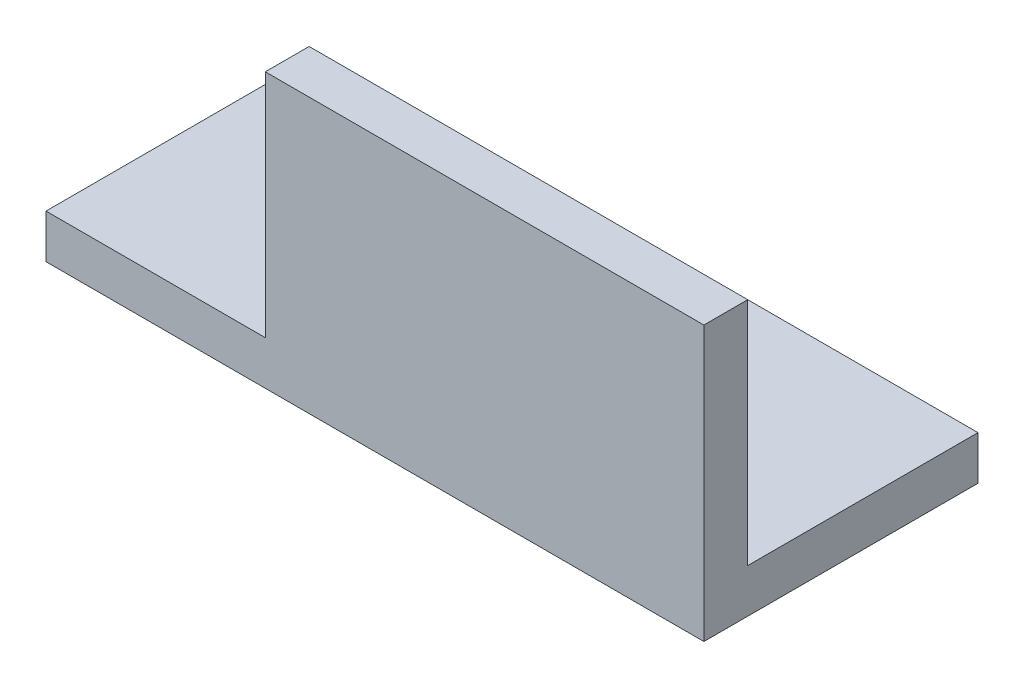
ISO-10303-21;
HEADER;
FILE_DESCRIPTION(('STEP AP214'),'2;1');
FILE_NAME('part.step','',(''),(''),'','','');
FILE_SCHEMA(('AUTOMOTIVE_DESIGN { 1 0 10303 214 1 1 1 1 }'));
ENDSEC;
DATA;
#1=APPLICATION_CONTEXT('core data for automotive mechanical design processes');
#2=APPLICATION_PROTOCOL_DEFINITION('international standard','automotive_design',2000,#1);
#3=PRODUCT_CONTEXT('',#1,'mechanical');
#4=PRODUCT('Part','Part','',(#3));
#5=PRODUCT_RELATED_PRODUCT_CATEGORY('part','',(#4));
#6=PRODUCT_DEFINITION_FORMATION('','',#4);
#7=PRODUCT_DEFINITION_CONTEXT('part definition',#1,'design');
#8=PRODUCT_DEFINITION('design','',#6,#7);
#9=PRODUCT_DEFINITION_SHAPE('','',#8);
#10=(LENGTH_UNIT() NAMED_UNIT(*) SI_UNIT(.MILLI.,.METRE.));
#11=(NAMED_UNIT(*) PLANE_ANGLE_UNIT() SI_UNIT($,.RADIAN.));
#12=(NAMED_UNIT(*) SI_UNIT($,.STERADIAN.) SOLID_ANGLE_UNIT());
#13=UNCERTAINTY_MEASURE_WITH_UNIT(LENGTH_MEASURE(1.E-05),#10,'distance_accuracy_value','');
#14=(GEOMETRIC_REPRESENTATION_CONTEXT(3) GLOBAL_UNCERTAINTY_ASSIGNED_CONTEXT((#13)) GLOBAL_UNIT_ASSIGNED_CONTEXT((#10,
#11,#12)) REPRESENTATION_CONTEXT('',''));
#15=CARTESIAN_POINT('',(0.,0.,0.));
#16=DIRECTION('',(0.,0.,1.));
#17=DIRECTION('',(1.,0.,0.));
#18=AXIS2_PLACEMENT_3D('',#15,#16,#17);
#19=CARTESIAN_POINT('',(60.,0.,-4.));
#20=DIRECTION('',(0.,0.,1.));
#21=DIRECTION('',(1.,0.,0.));
#22=AXIS2_PLACEMENT_3D('',#19,#20,#21);
#23=PLANE('',#22);
#24=DIRECTION('',(-1.,0.,0.));
#25=VECTOR('',#24,1.);
#26=CARTESIAN_POINT('',(60.,4.,-4.));
#27=LINE('',#26,#25);
#28=CARTESIAN_POINT('',(60.,4.,-4.));
#29=VERTEX_POINT('',#28);
#30=CARTESIAN_POINT('',(20.,4.,-4.));
#31=VERTEX_POINT('',#30);
#32=EDGE_CURVE('E103',#29,#31,#27,.T.);
#33=ORIENTED_EDGE('',*,*,#32,.T.);
#34=DIRECTION('',(0.,1.,0.));
#35=VECTOR('',#34,1.);
#36=CARTESIAN_POINT('',(20.,0.,-4.));
#37=LINE('',#36,#35);
#38=CARTESIAN_POINT('',(20.,25.,-4.));
#39=VERTEX_POINT('',#38);
#40=EDGE_CURVE('E110',#31,#39,#37,.T.);
#41=ORIENTED_EDGE('',*,*,#40,.T.);
#42=DIRECTION('',(-1.,0.,0.));
#43=VECTOR('',#42,1.);
#44=CARTESIAN_POINT('',(60.,25.,-4.));
#45=LINE('',#44,#43);
#46=CARTESIAN_POINT('',(60.,25.,-4.));
#47=VERTEX_POINT('',#46);
#48=EDGE_CURVE('E11',#47,#39,#45,.T.);
#49=ORIENTED_EDGE('',*,*,#48,.F.);
#50=DIRECTION('',(0.,1.,0.));
#51=VECTOR('',#50,1.);
#52=CARTESIAN_POINT('',(60.,0.,-4.));
#53=LINE('',#52,#51);
#54=EDGE_CURVE('E76',#29,#47,#53,.T.);
#55=ORIENTED_EDGE('',*,*,#54,.F.);
#56=EDGE_LOOP('',(#33,#41,#49,#55));
#57=FACE_BOUND('',#56,.T.);
#58=ADVANCED_FACE('F32',(#57),#23,.F.);
#59=CARTESIAN_POINT('',(60.,25.,0.));
#60=DIRECTION('',(0.,1.,0.));
#61=DIRECTION('',(0.,0.,1.));
#62=AXIS2_PLACEMENT_3D('',#59,#60,#61);
#63=PLANE('',#62);
#64=DIRECTION('',(0.,0.,1.));
#65=VECTOR('',#64,1.);
#66=CARTESIAN_POINT('',(20.,25.,-25.));
#67=LINE('',#66,#65);
#68=CARTESIAN_POINT('',(20.,25.,0.));
#69=VERTEX_POINT('',#68);
#70=EDGE_CURVE('E136',#39,#69,#67,.T.);
#71=ORIENTED_EDGE('',*,*,#70,.T.);
#72=DIRECTION('',(-1.,0.,0.));
#73=VECTOR('',#72,1.);
#74=CARTESIAN_POINT('',(60.,25.,0.));
#75=LINE('',#74,#73);
#76=CARTESIAN_POINT('',(60.,25.,0.));
#77=VERTEX_POINT('',#76);
#78=EDGE_CURVE('E40',#77,#69,#75,.T.);
#79=ORIENTED_EDGE('',*,*,#78,.F.);
#80=DIRECTION('',(0.,0.,-1.));
#81=VECTOR('',#80,1.);
#82=CARTESIAN_POINT('',(60.,25.,0.));
#83=LINE('',#82,#81);
#84=EDGE_CURVE('E134',#77,#47,#83,.T.);
#85=ORIENTED_EDGE('',*,*,#84,.T.);
#86=ORIENTED_EDGE('',*,*,#48,.T.);
#87=EDGE_LOOP('',(#71,#79,#85,#86));
#88=FACE_BOUND('',#87,.T.);
#89=ADVANCED_FACE('F133',(#88),#63,.T.);
#90=CARTESIAN_POINT('',(60.,0.,0.));
#91=DIRECTION('',(0.,0.,1.));
#92=DIRECTION('',(1.,0.,0.));
#93=AXIS2_PLACEMENT_3D('',#90,#91,#92);
#94=PLANE('',#93);
#95=DIRECTION('',(0.,1.,0.));
#96=VECTOR('',#95,1.);
#97=CARTESIAN_POINT('',(20.,25.,0.));
#98=LINE('',#97,#96);
#99=CARTESIAN_POINT('',(20.,4.,0.));
#100=VERTEX_POINT('',#99);
#101=EDGE_CURVE('E127',#100,#69,#98,.T.);
#102=ORIENTED_EDGE('',*,*,#101,.F.);
#103=DIRECTION('',(1.,0.,0.));
#104=VECTOR('',#103,1.);
#105=CARTESIAN_POINT('',(0.,4.,0.));
#106=LINE('',#105,#104);
#107=CARTESIAN_POINT('',(0.,4.,0.));
#108=VERTEX_POINT('',#107);
#109=EDGE_CURVE('E147',#108,#100,#106,.T.);
#110=ORIENTED_EDGE('',*,*,#109,.F.);
#111=DIRECTION('',(0.,1.,0.));
#112=VECTOR('',#111,1.);
#113=CARTESIAN_POINT('',(0.,0.,0.));
#114=LINE('',#113,#112);
#115=CARTESIAN_POINT('',(0.,0.,0.));
#116=VERTEX_POINT('',#115);
#117=EDGE_CURVE('E107',#116,#108,#114,.T.);
#118=ORIENTED_EDGE('',*,*,#117,.F.);
#119=DIRECTION('',(-1.,0.,0.));
#120=VECTOR('',#119,1.);
#121=CARTESIAN_POINT('',(60.,0.,0.));
#122=LINE('',#121,#120);
#123=CARTESIAN_POINT('',(60.,0.,0.));
#124=VERTEX_POINT('',#123);
#125=EDGE_CURVE('E93',#124,#116,#122,.T.);
#126=ORIENTED_EDGE('',*,*,#125,.F.);
#127=DIRECTION('',(0.,1.,0.));
#128=VECTOR('',#127,1.);
#129=CARTESIAN_POINT('',(60.,0.,0.));
#130=LINE('',#129,#128);
#131=EDGE_CURVE('E99',#124,#77,#130,.T.);
#132=ORIENTED_EDGE('',*,*,#131,.T.);
#133=ORIENTED_EDGE('',*,*,#78,.T.);
#134=EDGE_LOOP('',(#102,#110,#118,#126,#132,#133));
#135=FACE_BOUND('',#134,.T.);
#136=ADVANCED_FACE('F123',(#135),#94,.T.);
#137=CARTESIAN_POINT('',(60.,0.,0.));
#138=DIRECTION('',(0.,-1.,0.));
#139=DIRECTION('',(0.,0.,-1.));
#140=AXIS2_PLACEMENT_3D('',#137,#138,#139);
#141=PLANE('',#140);
#142=DIRECTION('',(0.,0.,1.));
#143=VECTOR('',#142,1.);
#144=CARTESIAN_POINT('',(0.,0.,0.));
#145=LINE('',#144,#143);
#146=CARTESIAN_POINT('',(0.,0.,-25.));
#147=VERTEX_POINT('',#146);
#148=EDGE_CURVE('E91',#147,#116,#145,.T.);
#149=ORIENTED_EDGE('',*,*,#148,.F.);
#150=DIRECTION('',(-1.,0.,0.));
#151=VECTOR('',#150,1.);
#152=CARTESIAN_POINT('',(60.,0.,-25.));
#153=LINE('',#152,#151);
#154=CARTESIAN_POINT('',(60.,0.,-25.));
#155=VERTEX_POINT('',#154);
#156=EDGE_CURVE('E64',#155,#147,#153,.T.);
#157=ORIENTED_EDGE('',*,*,#156,.F.);
#158=DIRECTION('',(0.,0.,1.));
#159=VECTOR('',#158,1.);
#160=CARTESIAN_POINT('',(60.,0.,0.));
#161=LINE('',#160,#159);
#162=EDGE_CURVE('E89',#155,#124,#161,.T.);
#163=ORIENTED_EDGE('',*,*,#162,.T.);
#164=ORIENTED_EDGE('',*,*,#125,.T.);
#165=EDGE_LOOP('',(#149,#157,#163,#164));
#166=FACE_BOUND('',#165,.T.);
#167=ADVANCED_FACE('F88',(#166),#141,.T.);
#168=CARTESIAN_POINT('',(60.,4.,-25.));
#169=DIRECTION('',(0.,0.,-1.));
#170=DIRECTION('',(-1.,0.,0.));
#171=AXIS2_PLACEMENT_3D('',#168,#169,#170);
#172=PLANE('',#171);
#173=DIRECTION('',(0.,-1.,0.));
#174=VECTOR('',#173,1.);
#175=CARTESIAN_POINT('',(0.,4.,-25.));
#176=LINE('',#175,#174);
#177=CARTESIAN_POINT('',(0.,4.,-25.));
#178=VERTEX_POINT('',#177);
#179=EDGE_CURVE('E112',#178,#147,#176,.T.);
#180=ORIENTED_EDGE('',*,*,#179,.F.);
#181=DIRECTION('',(-1.,0.,0.));
#182=VECTOR('',#181,1.);
#183=CARTESIAN_POINT('',(60.,4.,-25.));
#184=LINE('',#183,#182);
#185=CARTESIAN_POINT('',(60.,4.,-25.));
#186=VERTEX_POINT('',#185);
#187=EDGE_CURVE('E70',#186,#178,#184,.T.);
#188=ORIENTED_EDGE('',*,*,#187,.F.);
#189=DIRECTION('',(0.,-1.,0.));
#190=VECTOR('',#189,1.);
#191=CARTESIAN_POINT('',(60.,4.,-25.));
#192=LINE('',#191,#190);
#193=EDGE_CURVE('E97',#186,#155,#192,.T.);
#194=ORIENTED_EDGE('',*,*,#193,.T.);
#195=ORIENTED_EDGE('',*,*,#156,.T.);
#196=EDGE_LOOP('',(#180,#188,#194,#195));
#197=FACE_BOUND('',#196,.T.);
#198=ADVANCED_FACE('F101',(#197),#172,.T.);
#199=CARTESIAN_POINT('',(60.,4.,0.));
#200=DIRECTION('',(0.,-1.,0.));
#201=DIRECTION('',(0.,0.,-1.));
#202=AXIS2_PLACEMENT_3D('',#199,#200,#201);
#203=PLANE('',#202);
#204=ORIENTED_EDGE('',*,*,#187,.T.);
#205=DIRECTION('',(0.,0.,-1.));
#206=VECTOR('',#205,1.);
#207=CARTESIAN_POINT('',(0.,4.,0.));
#208=LINE('',#207,#206);
#209=EDGE_CURVE('E114',#178,#108,#208,.F.);
#210=ORIENTED_EDGE('',*,*,#209,.T.);
#211=ORIENTED_EDGE('',*,*,#109,.T.);
#212=DIRECTION('',(0.,0.,1.));
#213=VECTOR('',#212,1.);
#214=CARTESIAN_POINT('',(20.,4.,-25.));
#215=LINE('',#214,#213);
#216=EDGE_CURVE('E142',#31,#100,#215,.T.);
#217=ORIENTED_EDGE('',*,*,#216,.F.);
#218=ORIENTED_EDGE('',*,*,#32,.F.);
#219=DIRECTION('',(0.,0.,-1.));
#220=VECTOR('',#219,1.);
#221=CARTESIAN_POINT('',(60.,4.,0.));
#222=LINE('',#221,#220);
#223=EDGE_CURVE('E48',#186,#29,#222,.F.);
#224=ORIENTED_EDGE('',*,*,#223,.F.);
#225=EDGE_LOOP('',(#204,#210,#211,#217,#218,#224));
#226=FACE_BOUND('',#225,.T.);
#227=ADVANCED_FACE('F150',(#226),#203,.F.);
#228=CARTESIAN_POINT('',(60.,0.,0.));
#229=DIRECTION('',(-1.,0.,0.));
#230=DIRECTION('',(0.,0.,1.));
#231=AXIS2_PLACEMENT_3D('',#228,#229,#230);
#232=PLANE('',#231);
#233=ORIENTED_EDGE('',*,*,#54,.T.);
#234=ORIENTED_EDGE('',*,*,#84,.F.);
#235=ORIENTED_EDGE('',*,*,#131,.F.);
#236=ORIENTED_EDGE('',*,*,#162,.F.);
#237=ORIENTED_EDGE('',*,*,#193,.F.);
#238=ORIENTED_EDGE('',*,*,#223,.T.);
#239=EDGE_LOOP('',(#233,#234,#235,#236,#237,#238));
#240=FACE_BOUND('',#239,.T.);
#241=ADVANCED_FACE('F96',(#240),#232,.F.);
#242=CARTESIAN_POINT('',(0.,0.,0.));
#243=DIRECTION('',(-1.,0.,0.));
#244=DIRECTION('',(0.,0.,1.));
#245=AXIS2_PLACEMENT_3D('',#242,#243,#244);
#246=PLANE('',#245);
#247=ORIENTED_EDGE('',*,*,#117,.T.);
#248=ORIENTED_EDGE('',*,*,#209,.F.);
#249=ORIENTED_EDGE('',*,*,#179,.T.);
#250=ORIENTED_EDGE('',*,*,#148,.T.);
#251=EDGE_LOOP('',(#247,#248,#249,#250));
#252=FACE_BOUND('',#251,.T.);
#253=ADVANCED_FACE('F156',(#252),#246,.T.);
#254=CARTESIAN_POINT('',(20.,25.,-25.));
#255=DIRECTION('',(1.,0.,0.));
#256=DIRECTION('',(0.,1.,0.));
#257=AXIS2_PLACEMENT_3D('',#254,#255,#256);
#258=PLANE('',#257);
#259=ORIENTED_EDGE('',*,*,#216,.T.);
#260=ORIENTED_EDGE('',*,*,#101,.T.);
#261=ORIENTED_EDGE('',*,*,#70,.F.);
#262=ORIENTED_EDGE('',*,*,#40,.F.);
#263=EDGE_LOOP('',(#259,#260,#261,#262));
#264=FACE_BOUND('',#263,.T.);
#265=ADVANCED_FACE('F158',(#264),#258,.F.);
#266=CLOSED_SHELL('',(#58,#89,#136,#167,#198,#227,#241,#253,#265));
#267=MANIFOLD_SOLID_BREP('B2',#266);
#268=ADVANCED_BREP_SHAPE_REPRESENTATION('',(#18,#267),#14);
#269=SHAPE_DEFINITION_REPRESENTATION(#9,#268);
ENDSEC;
END-ISO-10303-21;
